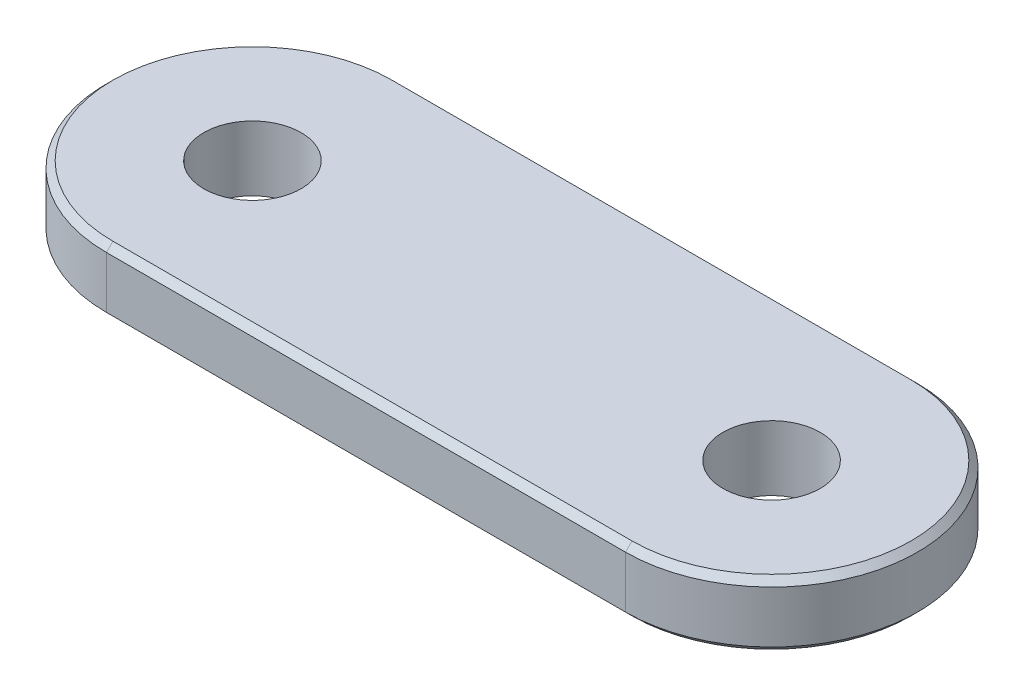
ISO-10303-21;
HEADER;
FILE_DESCRIPTION(('STEP AP214'),'2;1');
FILE_NAME('part.step','',(''),(''),'','','');
FILE_SCHEMA(('AUTOMOTIVE_DESIGN { 1 0 10303 214 1 1 1 1 }'));
ENDSEC;
DATA;
#1=APPLICATION_CONTEXT('core data for automotive mechanical design processes');
#2=APPLICATION_PROTOCOL_DEFINITION('international standard','automotive_design',2000,#1);
#3=PRODUCT_CONTEXT('',#1,'mechanical');
#4=PRODUCT('Part','Part','',(#3));
#5=PRODUCT_RELATED_PRODUCT_CATEGORY('part','',(#4));
#6=PRODUCT_DEFINITION_FORMATION('','',#4);
#7=PRODUCT_DEFINITION_CONTEXT('part definition',#1,'design');
#8=PRODUCT_DEFINITION('design','',#6,#7);
#9=PRODUCT_DEFINITION_SHAPE('','',#8);
#10=(LENGTH_UNIT() NAMED_UNIT(*) SI_UNIT(.MILLI.,.METRE.));
#11=(NAMED_UNIT(*) PLANE_ANGLE_UNIT() SI_UNIT($,.RADIAN.));
#12=(NAMED_UNIT(*) SI_UNIT($,.STERADIAN.) SOLID_ANGLE_UNIT());
#13=UNCERTAINTY_MEASURE_WITH_UNIT(LENGTH_MEASURE(1.E-05),#10,'distance_accuracy_value','');
#14=(GEOMETRIC_REPRESENTATION_CONTEXT(3) GLOBAL_UNCERTAINTY_ASSIGNED_CONTEXT((#13)) GLOBAL_UNIT_ASSIGNED_CONTEXT((#10,
#11,#12)) REPRESENTATION_CONTEXT('',''));
#15=CARTESIAN_POINT('',(0.,0.,0.));
#16=DIRECTION('',(0.,0.,1.));
#17=DIRECTION('',(1.,0.,0.));
#18=AXIS2_PLACEMENT_3D('',#15,#16,#17);
#19=CARTESIAN_POINT('',(-80.,20.,0.));
#20=DIRECTION('',(0.,-1.,0.));
#21=DIRECTION('',(0.,0.,-1.));
#22=AXIS2_PLACEMENT_3D('',#19,#20,#21);
#23=CYLINDRICAL_SURFACE('',#22,45.);
#24=DIRECTION('',(0.,-1.,0.));
#25=VECTOR('',#24,1.);
#26=CARTESIAN_POINT('',(-80.,20.,45.));
#27=LINE('',#26,#25);
#28=CARTESIAN_POINT('',(-80.,18.,45.));
#29=VERTEX_POINT('',#28);
#30=CARTESIAN_POINT('',(-80.,1.99999999999997,45.));
#31=VERTEX_POINT('',#30);
#32=EDGE_CURVE('E125',#29,#31,#27,.T.);
#33=ORIENTED_EDGE('',*,*,#32,.F.);
#34=CARTESIAN_POINT('',(-80.,18.,0.));
#35=DIRECTION('',(0.,1.,0.));
#36=DIRECTION('',(0.,0.,1.));
#37=AXIS2_PLACEMENT_3D('',#34,#35,#36);
#38=CIRCLE('',#37,45.);
#39=CARTESIAN_POINT('',(-80.,18.,-45.));
#40=VERTEX_POINT('',#39);
#41=EDGE_CURVE('E128',#29,#40,#38,.F.);
#42=ORIENTED_EDGE('',*,*,#41,.T.);
#43=DIRECTION('',(0.,-1.,0.));
#44=VECTOR('',#43,1.);
#45=CARTESIAN_POINT('',(-80.,20.,-45.));
#46=LINE('',#45,#44);
#47=CARTESIAN_POINT('',(-80.,1.99999999999997,-45.));
#48=VERTEX_POINT('',#47);
#49=EDGE_CURVE('E183',#40,#48,#46,.T.);
#50=ORIENTED_EDGE('',*,*,#49,.T.);
#51=CARTESIAN_POINT('',(-80.,1.99999999999997,0.));
#52=DIRECTION('',(0.,1.,0.));
#53=DIRECTION('',(0.,0.,1.));
#54=AXIS2_PLACEMENT_3D('',#51,#52,#53);
#55=CIRCLE('',#54,45.);
#56=EDGE_CURVE('E165',#48,#31,#55,.T.);
#57=ORIENTED_EDGE('',*,*,#56,.T.);
#58=EDGE_LOOP('',(#33,#42,#50,#57));
#59=FACE_BOUND('',#58,.T.);
#60=ADVANCED_FACE('F35',(#59),#23,.T.);
#61=CARTESIAN_POINT('',(80.,20.,45.));
#62=DIRECTION('',(0.,0.,-1.));
#63=DIRECTION('',(-1.,0.,0.));
#64=AXIS2_PLACEMENT_3D('',#61,#62,#63);
#65=PLANE('',#64);
#66=DIRECTION('',(0.,-1.,0.));
#67=VECTOR('',#66,1.);
#68=CARTESIAN_POINT('',(80.,20.,45.));
#69=LINE('',#68,#67);
#70=CARTESIAN_POINT('',(80.,18.,45.));
#71=VERTEX_POINT('',#70);
#72=CARTESIAN_POINT('',(80.,1.99999999999997,45.));
#73=VERTEX_POINT('',#72);
#74=EDGE_CURVE('E177',#71,#73,#69,.T.);
#75=ORIENTED_EDGE('',*,*,#74,.F.);
#76=DIRECTION('',(-1.,0.,0.));
#77=VECTOR('',#76,1.);
#78=CARTESIAN_POINT('',(-80.,18.,45.));
#79=LINE('',#78,#77);
#80=EDGE_CURVE('E156',#71,#29,#79,.T.);
#81=ORIENTED_EDGE('',*,*,#80,.T.);
#82=ORIENTED_EDGE('',*,*,#32,.T.);
#83=DIRECTION('',(1.,0.,0.));
#84=VECTOR('',#83,1.);
#85=CARTESIAN_POINT('',(80.,1.99999999999997,45.));
#86=LINE('',#85,#84);
#87=EDGE_CURVE('E158',#31,#73,#86,.T.);
#88=ORIENTED_EDGE('',*,*,#87,.T.);
#89=EDGE_LOOP('',(#75,#81,#82,#88));
#90=FACE_BOUND('',#89,.T.);
#91=ADVANCED_FACE('F222',(#90),#65,.F.);
#92=CARTESIAN_POINT('',(80.,20.,0.));
#93=DIRECTION('',(0.,-1.,0.));
#94=DIRECTION('',(0.,0.,-1.));
#95=AXIS2_PLACEMENT_3D('',#92,#93,#94);
#96=CYLINDRICAL_SURFACE('',#95,45.);
#97=DIRECTION('',(0.,-1.,0.));
#98=VECTOR('',#97,1.);
#99=CARTESIAN_POINT('',(80.,20.,-45.));
#100=LINE('',#99,#98);
#101=CARTESIAN_POINT('',(80.,18.,-45.));
#102=VERTEX_POINT('',#101);
#103=CARTESIAN_POINT('',(80.,1.99999999999997,-45.));
#104=VERTEX_POINT('',#103);
#105=EDGE_CURVE('E180',#102,#104,#100,.T.);
#106=ORIENTED_EDGE('',*,*,#105,.F.);
#107=CARTESIAN_POINT('',(80.,18.,0.));
#108=DIRECTION('',(0.,1.,0.));
#109=DIRECTION('',(0.,0.,1.));
#110=AXIS2_PLACEMENT_3D('',#107,#108,#109);
#111=CIRCLE('',#110,45.);
#112=EDGE_CURVE('E160',#102,#71,#111,.F.);
#113=ORIENTED_EDGE('',*,*,#112,.T.);
#114=ORIENTED_EDGE('',*,*,#74,.T.);
#115=CARTESIAN_POINT('',(80.,1.99999999999997,0.));
#116=DIRECTION('',(0.,1.,0.));
#117=DIRECTION('',(0.,0.,1.));
#118=AXIS2_PLACEMENT_3D('',#115,#116,#117);
#119=CIRCLE('',#118,45.);
#120=EDGE_CURVE('E162',#73,#104,#119,.T.);
#121=ORIENTED_EDGE('',*,*,#120,.T.);
#122=EDGE_LOOP('',(#106,#113,#114,#121));
#123=FACE_BOUND('',#122,.T.);
#124=ADVANCED_FACE('F228',(#123),#96,.T.);
#125=CARTESIAN_POINT('',(-80.,20.,-45.));
#126=DIRECTION('',(0.,0.,1.));
#127=DIRECTION('',(1.,0.,0.));
#128=AXIS2_PLACEMENT_3D('',#125,#126,#127);
#129=PLANE('',#128);
#130=ORIENTED_EDGE('',*,*,#49,.F.);
#131=DIRECTION('',(1.,0.,0.));
#132=VECTOR('',#131,1.);
#133=CARTESIAN_POINT('',(80.,18.,-45.));
#134=LINE('',#133,#132);
#135=EDGE_CURVE('E167',#40,#102,#134,.T.);
#136=ORIENTED_EDGE('',*,*,#135,.T.);
#137=ORIENTED_EDGE('',*,*,#105,.T.);
#138=DIRECTION('',(-1.,0.,0.));
#139=VECTOR('',#138,1.);
#140=CARTESIAN_POINT('',(-80.,1.99999999999997,-45.));
#141=LINE('',#140,#139);
#142=EDGE_CURVE('E170',#104,#48,#141,.T.);
#143=ORIENTED_EDGE('',*,*,#142,.T.);
#144=EDGE_LOOP('',(#130,#136,#137,#143));
#145=FACE_BOUND('',#144,.T.);
#146=ADVANCED_FACE('F209',(#145),#129,.F.);
#147=CARTESIAN_POINT('',(-80.,20.,0.));
#148=DIRECTION('',(0.,1.,0.));
#149=DIRECTION('',(0.,0.,1.));
#150=AXIS2_PLACEMENT_3D('',#147,#148,#149);
#151=PLANE('',#150);
#152=CARTESIAN_POINT('',(80.,20.,0.));
#153=DIRECTION('',(0.,1.,0.));
#154=DIRECTION('',(0.,0.,1.));
#155=AXIS2_PLACEMENT_3D('',#152,#153,#154);
#156=CIRCLE('',#155,43.);
#157=CARTESIAN_POINT('',(80.,20.,43.));
#158=VERTEX_POINT('',#157);
#159=CARTESIAN_POINT('',(80.,20.,-43.));
#160=VERTEX_POINT('',#159);
#161=EDGE_CURVE('E114',#158,#160,#156,.T.);
#162=ORIENTED_EDGE('',*,*,#161,.T.);
#163=DIRECTION('',(-1.,0.,0.));
#164=VECTOR('',#163,1.);
#165=CARTESIAN_POINT('',(-80.,20.,-43.));
#166=LINE('',#165,#164);
#167=CARTESIAN_POINT('',(-80.,20.,-43.));
#168=VERTEX_POINT('',#167);
#169=EDGE_CURVE('E110',#160,#168,#166,.T.);
#170=ORIENTED_EDGE('',*,*,#169,.T.);
#171=CARTESIAN_POINT('',(-80.,20.,0.));
#172=DIRECTION('',(0.,1.,0.));
#173=DIRECTION('',(0.,0.,1.));
#174=AXIS2_PLACEMENT_3D('',#171,#172,#173);
#175=CIRCLE('',#174,43.);
#176=CARTESIAN_POINT('',(-80.,20.,43.));
#177=VERTEX_POINT('',#176);
#178=EDGE_CURVE('E103',#168,#177,#175,.T.);
#179=ORIENTED_EDGE('',*,*,#178,.T.);
#180=DIRECTION('',(1.,0.,0.));
#181=VECTOR('',#180,1.);
#182=CARTESIAN_POINT('',(80.,20.,43.));
#183=LINE('',#182,#181);
#184=EDGE_CURVE('E107',#177,#158,#183,.T.);
#185=ORIENTED_EDGE('',*,*,#184,.T.);
#186=EDGE_LOOP('',(#162,#170,#179,#185));
#187=FACE_BOUND('',#186,.T.);
#188=CARTESIAN_POINT('',(-80.,20.,0.));
#189=DIRECTION('',(0.,1.,0.));
#190=DIRECTION('',(0.,0.,1.));
#191=AXIS2_PLACEMENT_3D('',#188,#189,#190);
#192=CIRCLE('',#191,15.);
#193=CARTESIAN_POINT('',(-80.,20.,15.));
#194=VERTEX_POINT('',#193);
#195=EDGE_CURVE('E192',#194,#194,#192,.T.);
#196=ORIENTED_EDGE('',*,*,#195,.F.);
#197=EDGE_LOOP('',(#196));
#198=FACE_BOUND('',#197,.T.);
#199=CARTESIAN_POINT('',(80.,20.,0.));
#200=DIRECTION('',(0.,1.,0.));
#201=DIRECTION('',(0.,0.,-1.));
#202=AXIS2_PLACEMENT_3D('',#199,#200,#201);
#203=CIRCLE('',#202,15.);
#204=CARTESIAN_POINT('',(80.,20.,-15.));
#205=VERTEX_POINT('',#204);
#206=EDGE_CURVE('E131',#205,#205,#203,.T.);
#207=ORIENTED_EDGE('',*,*,#206,.F.);
#208=EDGE_LOOP('',(#207));
#209=FACE_BOUND('',#208,.T.);
#210=ADVANCED_FACE('F105',(#187,#198,#209),#151,.T.);
#211=CARTESIAN_POINT('',(-80.,0.,0.));
#212=DIRECTION('',(0.,1.,0.));
#213=DIRECTION('',(0.,0.,1.));
#214=AXIS2_PLACEMENT_3D('',#211,#212,#213);
#215=PLANE('',#214);
#216=CARTESIAN_POINT('',(-80.,0.,0.));
#217=DIRECTION('',(0.,1.,0.));
#218=DIRECTION('',(0.,0.,1.));
#219=AXIS2_PLACEMENT_3D('',#216,#217,#218);
#220=CIRCLE('',#219,43.);
#221=CARTESIAN_POINT('',(-80.,0.,43.));
#222=VERTEX_POINT('',#221);
#223=CARTESIAN_POINT('',(-80.,0.,-43.));
#224=VERTEX_POINT('',#223);
#225=EDGE_CURVE('E45',#222,#224,#220,.F.);
#226=ORIENTED_EDGE('',*,*,#225,.T.);
#227=DIRECTION('',(1.,0.,0.));
#228=VECTOR('',#227,1.);
#229=CARTESIAN_POINT('',(-80.,0.,-43.));
#230=LINE('',#229,#228);
#231=CARTESIAN_POINT('',(80.,0.,-43.));
#232=VERTEX_POINT('',#231);
#233=EDGE_CURVE('E11',#224,#232,#230,.T.);
#234=ORIENTED_EDGE('',*,*,#233,.T.);
#235=CARTESIAN_POINT('',(80.,0.,0.));
#236=DIRECTION('',(0.,1.,0.));
#237=DIRECTION('',(0.,0.,1.));
#238=AXIS2_PLACEMENT_3D('',#235,#236,#237);
#239=CIRCLE('',#238,43.);
#240=CARTESIAN_POINT('',(80.,0.,43.));
#241=VERTEX_POINT('',#240);
#242=EDGE_CURVE('E152',#232,#241,#239,.F.);
#243=ORIENTED_EDGE('',*,*,#242,.T.);
#244=DIRECTION('',(-1.,0.,0.));
#245=VECTOR('',#244,1.);
#246=CARTESIAN_POINT('',(-80.,0.,43.));
#247=LINE('',#246,#245);
#248=EDGE_CURVE('E154',#241,#222,#247,.T.);
#249=ORIENTED_EDGE('',*,*,#248,.T.);
#250=EDGE_LOOP('',(#226,#234,#243,#249));
#251=FACE_BOUND('',#250,.T.);
#252=CARTESIAN_POINT('',(-80.,0.,0.));
#253=DIRECTION('',(0.,1.,0.));
#254=DIRECTION('',(0.,0.,1.));
#255=AXIS2_PLACEMENT_3D('',#252,#253,#254);
#256=CIRCLE('',#255,15.);
#257=CARTESIAN_POINT('',(-80.,0.,15.));
#258=VERTEX_POINT('',#257);
#259=EDGE_CURVE('E186',#258,#258,#256,.T.);
#260=ORIENTED_EDGE('',*,*,#259,.T.);
#261=EDGE_LOOP('',(#260));
#262=FACE_BOUND('',#261,.T.);
#263=CARTESIAN_POINT('',(80.,0.,0.));
#264=DIRECTION('',(0.,1.,0.));
#265=DIRECTION('',(0.,0.,-1.));
#266=AXIS2_PLACEMENT_3D('',#263,#264,#265);
#267=CIRCLE('',#266,15.);
#268=CARTESIAN_POINT('',(80.,0.,-15.));
#269=VERTEX_POINT('',#268);
#270=EDGE_CURVE('E189',#269,#269,#267,.T.);
#271=ORIENTED_EDGE('',*,*,#270,.T.);
#272=EDGE_LOOP('',(#271));
#273=FACE_BOUND('',#272,.T.);
#274=ADVANCED_FACE('F198',(#251,#262,#273),#215,.F.);
#275=CARTESIAN_POINT('',(80.,0.,0.));
#276=DIRECTION('',(0.,1.,0.));
#277=DIRECTION('',(0.,0.,1.));
#278=AXIS2_PLACEMENT_3D('',#275,#276,#277);
#279=CYLINDRICAL_SURFACE('',#278,15.);
#280=ORIENTED_EDGE('',*,*,#270,.F.);
#281=EDGE_LOOP('',(#280));
#282=FACE_BOUND('',#281,.T.);
#283=ORIENTED_EDGE('',*,*,#206,.T.);
#284=EDGE_LOOP('',(#283));
#285=FACE_BOUND('',#284,.T.);
#286=ADVANCED_FACE('F204',(#282,#285),#279,.F.);
#287=CARTESIAN_POINT('',(-80.,0.,0.));
#288=DIRECTION('',(0.,1.,0.));
#289=DIRECTION('',(0.,0.,1.));
#290=AXIS2_PLACEMENT_3D('',#287,#288,#289);
#291=CYLINDRICAL_SURFACE('',#290,15.);
#292=ORIENTED_EDGE('',*,*,#259,.F.);
#293=EDGE_LOOP('',(#292));
#294=FACE_BOUND('',#293,.T.);
#295=ORIENTED_EDGE('',*,*,#195,.T.);
#296=EDGE_LOOP('',(#295));
#297=FACE_BOUND('',#296,.T.);
#298=ADVANCED_FACE('F201',(#294,#297),#291,.F.);
#299=CARTESIAN_POINT('',(-80.,20.,43.));
#300=DIRECTION('',(0.,0.707106781186543,0.707106781186552));
#301=DIRECTION('',(-1.,0.,0.));
#302=AXIS2_PLACEMENT_3D('',#299,#300,#301);
#303=PLANE('',#302);
#304=DIRECTION('',(0.,0.707106781186552,-0.707106781186543));
#305=VECTOR('',#304,1.);
#306=CARTESIAN_POINT('',(-80.,18.,45.));
#307=LINE('',#306,#305);
#308=EDGE_CURVE('E120',#29,#177,#307,.T.);
#309=ORIENTED_EDGE('',*,*,#308,.F.);
#310=ORIENTED_EDGE('',*,*,#80,.F.);
#311=DIRECTION('',(0.,-0.707106781186552,0.707106781186543));
#312=VECTOR('',#311,1.);
#313=CARTESIAN_POINT('',(80.,20.,43.));
#314=LINE('',#313,#312);
#315=EDGE_CURVE('E123',#158,#71,#314,.T.);
#316=ORIENTED_EDGE('',*,*,#315,.F.);
#317=ORIENTED_EDGE('',*,*,#184,.F.);
#318=EDGE_LOOP('',(#309,#310,#316,#317));
#319=FACE_BOUND('',#318,.T.);
#320=ADVANCED_FACE('F118',(#319),#303,.T.);
#321=CARTESIAN_POINT('',(80.,20.,0.));
#322=DIRECTION('',(0.,-1.,0.));
#323=DIRECTION('',(0.,0.,-1.));
#324=AXIS2_PLACEMENT_3D('',#321,#322,#323);
#325=CONICAL_SURFACE('',#324,43.,0.785398163397441);
#326=ORIENTED_EDGE('',*,*,#315,.T.);
#327=ORIENTED_EDGE('',*,*,#112,.F.);
#328=DIRECTION('',(0.,-0.707106781186552,-0.707106781186543));
#329=VECTOR('',#328,1.);
#330=CARTESIAN_POINT('',(80.,20.,-43.));
#331=LINE('',#330,#329);
#332=EDGE_CURVE('E129',#160,#102,#331,.T.);
#333=ORIENTED_EDGE('',*,*,#332,.F.);
#334=ORIENTED_EDGE('',*,*,#161,.F.);
#335=EDGE_LOOP('',(#326,#327,#333,#334));
#336=FACE_BOUND('',#335,.T.);
#337=ADVANCED_FACE('F246',(#336),#325,.T.);
#338=CARTESIAN_POINT('',(-80.,20.,0.));
#339=DIRECTION('',(0.,-1.,0.));
#340=DIRECTION('',(0.,0.,-1.));
#341=AXIS2_PLACEMENT_3D('',#338,#339,#340);
#342=CONICAL_SURFACE('',#341,43.,0.785398163397441);
#343=ORIENTED_EDGE('',*,*,#308,.T.);
#344=ORIENTED_EDGE('',*,*,#178,.F.);
#345=DIRECTION('',(0.,0.707106781186552,0.707106781186543));
#346=VECTOR('',#345,1.);
#347=CARTESIAN_POINT('',(-80.,18.,-45.));
#348=LINE('',#347,#346);
#349=EDGE_CURVE('E133',#40,#168,#348,.T.);
#350=ORIENTED_EDGE('',*,*,#349,.F.);
#351=ORIENTED_EDGE('',*,*,#41,.F.);
#352=EDGE_LOOP('',(#343,#344,#350,#351));
#353=FACE_BOUND('',#352,.T.);
#354=ADVANCED_FACE('F127',(#353),#342,.T.);
#355=CARTESIAN_POINT('',(-80.,20.,-43.));
#356=DIRECTION('',(0.,0.707106781186543,-0.707106781186552));
#357=DIRECTION('',(1.,0.,0.));
#358=AXIS2_PLACEMENT_3D('',#355,#356,#357);
#359=PLANE('',#358);
#360=ORIENTED_EDGE('',*,*,#332,.T.);
#361=ORIENTED_EDGE('',*,*,#135,.F.);
#362=ORIENTED_EDGE('',*,*,#349,.T.);
#363=ORIENTED_EDGE('',*,*,#169,.F.);
#364=EDGE_LOOP('',(#360,#361,#362,#363));
#365=FACE_BOUND('',#364,.T.);
#366=ADVANCED_FACE('F235',(#365),#359,.T.);
#367=CARTESIAN_POINT('',(80.,1.99999999999997,45.));
#368=DIRECTION('',(0.,0.707106781186552,-0.707106781186543));
#369=DIRECTION('',(1.,0.,0.));
#370=AXIS2_PLACEMENT_3D('',#367,#368,#369);
#371=PLANE('',#370);
#372=DIRECTION('',(0.,0.707106781186543,0.707106781186552));
#373=VECTOR('',#372,1.);
#374=CARTESIAN_POINT('',(-80.,0.,43.));
#375=LINE('',#374,#373);
#376=EDGE_CURVE('E139',#222,#31,#375,.T.);
#377=ORIENTED_EDGE('',*,*,#376,.F.);
#378=ORIENTED_EDGE('',*,*,#248,.F.);
#379=DIRECTION('',(0.,-0.707106781186543,-0.707106781186552));
#380=VECTOR('',#379,1.);
#381=CARTESIAN_POINT('',(80.,1.99999999999997,45.));
#382=LINE('',#381,#380);
#383=EDGE_CURVE('E40',#73,#241,#382,.T.);
#384=ORIENTED_EDGE('',*,*,#383,.F.);
#385=ORIENTED_EDGE('',*,*,#87,.F.);
#386=EDGE_LOOP('',(#377,#378,#384,#385));
#387=FACE_BOUND('',#386,.T.);
#388=ADVANCED_FACE('F38',(#387),#371,.F.);
#389=CARTESIAN_POINT('',(80.,1.99999999999997,0.));
#390=DIRECTION('',(0.,1.,0.));
#391=DIRECTION('',(0.,0.,1.));
#392=AXIS2_PLACEMENT_3D('',#389,#390,#391);
#393=CONICAL_SURFACE('',#392,45.,0.785398163397455);
#394=ORIENTED_EDGE('',*,*,#383,.T.);
#395=ORIENTED_EDGE('',*,*,#242,.F.);
#396=DIRECTION('',(0.,-0.707106781186543,0.707106781186552));
#397=VECTOR('',#396,1.);
#398=CARTESIAN_POINT('',(80.,1.99999999999997,-45.));
#399=LINE('',#398,#397);
#400=EDGE_CURVE('E58',#104,#232,#399,.T.);
#401=ORIENTED_EDGE('',*,*,#400,.F.);
#402=ORIENTED_EDGE('',*,*,#120,.F.);
#403=EDGE_LOOP('',(#394,#395,#401,#402));
#404=FACE_BOUND('',#403,.T.);
#405=ADVANCED_FACE('F269',(#404),#393,.T.);
#406=CARTESIAN_POINT('',(-80.,1.99999999999997,0.));
#407=DIRECTION('',(0.,1.,0.));
#408=DIRECTION('',(0.,0.,1.));
#409=AXIS2_PLACEMENT_3D('',#406,#407,#408);
#410=CONICAL_SURFACE('',#409,45.,0.785398163397455);
#411=ORIENTED_EDGE('',*,*,#376,.T.);
#412=ORIENTED_EDGE('',*,*,#56,.F.);
#413=DIRECTION('',(0.,0.707106781186543,-0.707106781186552));
#414=VECTOR('',#413,1.);
#415=CARTESIAN_POINT('',(-80.,0.,-43.));
#416=LINE('',#415,#414);
#417=EDGE_CURVE('E137',#224,#48,#416,.T.);
#418=ORIENTED_EDGE('',*,*,#417,.F.);
#419=ORIENTED_EDGE('',*,*,#225,.F.);
#420=EDGE_LOOP('',(#411,#412,#418,#419));
#421=FACE_BOUND('',#420,.T.);
#422=ADVANCED_FACE('F264',(#421),#410,.T.);
#423=CARTESIAN_POINT('',(-80.,1.99999999999997,-45.));
#424=DIRECTION('',(0.,0.707106781186552,0.707106781186543));
#425=DIRECTION('',(-1.,0.,0.));
#426=AXIS2_PLACEMENT_3D('',#423,#424,#425);
#427=PLANE('',#426);
#428=ORIENTED_EDGE('',*,*,#400,.T.);
#429=ORIENTED_EDGE('',*,*,#233,.F.);
#430=ORIENTED_EDGE('',*,*,#417,.T.);
#431=ORIENTED_EDGE('',*,*,#142,.F.);
#432=EDGE_LOOP('',(#428,#429,#430,#431));
#433=FACE_BOUND('',#432,.T.);
#434=ADVANCED_FACE('F258',(#433),#427,.F.);
#435=CLOSED_SHELL('',(#60,#91,#124,#146,#210,#274,#286,#298,#320,#337,#354,#366,#388,#405,#422,#434));
#436=MANIFOLD_SOLID_BREP('B2',#435);
#437=ADVANCED_BREP_SHAPE_REPRESENTATION('',(#18,#436),#14);
#438=SHAPE_DEFINITION_REPRESENTATION(#9,#437);
ENDSEC;
END-ISO-10303-21;
